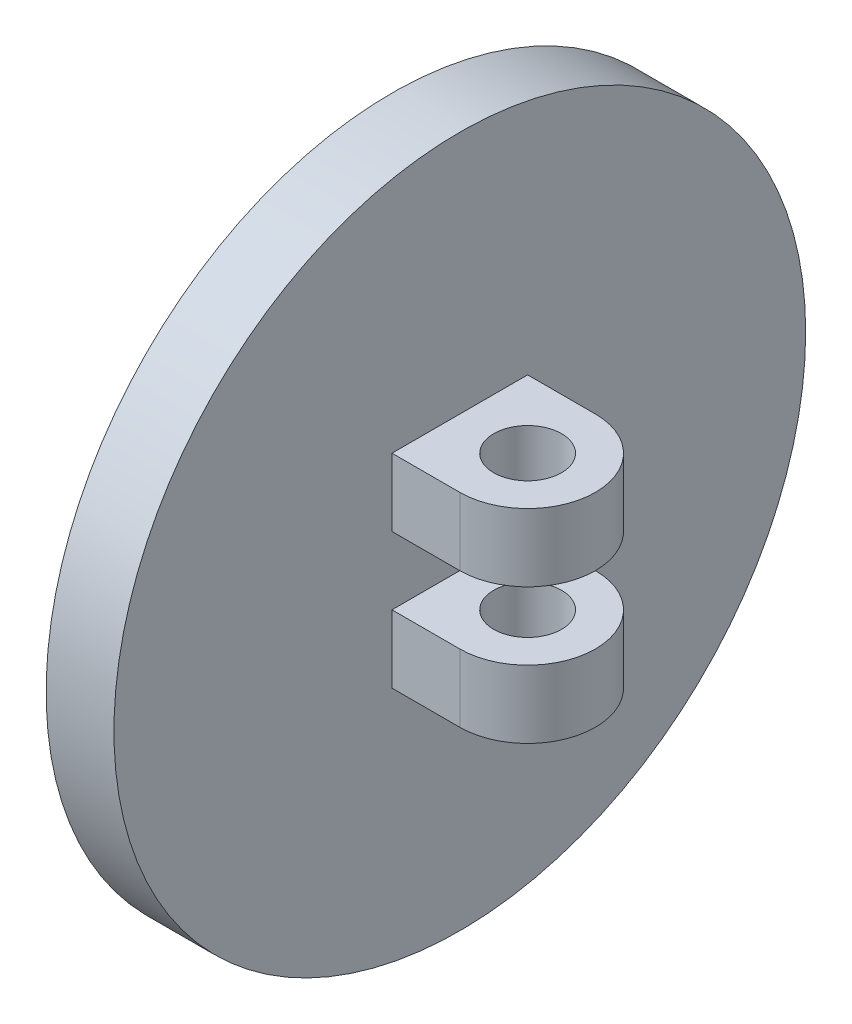
ISO-10303-21;
HEADER;
FILE_DESCRIPTION(('STEP AP214'),'2;1');
FILE_NAME('part.step','',(''),(''),'','','');
FILE_SCHEMA(('AUTOMOTIVE_DESIGN { 1 0 10303 214 1 1 1 1 }'));
ENDSEC;
DATA;
#1=APPLICATION_CONTEXT('core data for automotive mechanical design processes');
#2=APPLICATION_PROTOCOL_DEFINITION('international standard','automotive_design',2000,#1);
#3=PRODUCT_CONTEXT('',#1,'mechanical');
#4=PRODUCT('Part','Part','',(#3));
#5=PRODUCT_RELATED_PRODUCT_CATEGORY('part','',(#4));
#6=PRODUCT_DEFINITION_FORMATION('','',#4);
#7=PRODUCT_DEFINITION_CONTEXT('part definition',#1,'design');
#8=PRODUCT_DEFINITION('design','',#6,#7);
#9=PRODUCT_DEFINITION_SHAPE('','',#8);
#10=(LENGTH_UNIT() NAMED_UNIT(*) SI_UNIT(.MILLI.,.METRE.));
#11=(NAMED_UNIT(*) PLANE_ANGLE_UNIT() SI_UNIT($,.RADIAN.));
#12=(NAMED_UNIT(*) SI_UNIT($,.STERADIAN.) SOLID_ANGLE_UNIT());
#13=UNCERTAINTY_MEASURE_WITH_UNIT(LENGTH_MEASURE(1.E-05),#10,'distance_accuracy_value','');
#14=(GEOMETRIC_REPRESENTATION_CONTEXT(3) GLOBAL_UNCERTAINTY_ASSIGNED_CONTEXT((#13)) GLOBAL_UNIT_ASSIGNED_CONTEXT((#10,
#11,#12)) REPRESENTATION_CONTEXT('',''));
#15=CARTESIAN_POINT('',(0.,0.,0.));
#16=DIRECTION('',(0.,0.,1.));
#17=DIRECTION('',(1.,0.,0.));
#18=AXIS2_PLACEMENT_3D('',#15,#16,#17);
#19=CARTESIAN_POINT('',(1.,0.,0.));
#20=DIRECTION('',(1.,0.,0.));
#21=DIRECTION('',(0.,0.,-1.));
#22=AXIS2_PLACEMENT_3D('',#19,#20,#21);
#23=PLANE('',#22);
#24=CARTESIAN_POINT('',(1.,0.,0.));
#25=DIRECTION('',(1.,0.,0.));
#26=DIRECTION('',(0.,0.,-1.));
#27=AXIS2_PLACEMENT_3D('',#24,#25,#26);
#28=CIRCLE('',#27,5.1);
#29=CARTESIAN_POINT('',(1.,0.,-5.1));
#30=VERTEX_POINT('',#29);
#31=EDGE_CURVE('E11',#30,#30,#28,.T.);
#32=ORIENTED_EDGE('',*,*,#31,.T.);
#33=EDGE_LOOP('',(#32));
#34=FACE_BOUND('',#33,.T.);
#35=DIRECTION('',(0.,0.,1.));
#36=VECTOR('',#35,1.);
#37=CARTESIAN_POINT('',(1.,0.5,-1.));
#38=LINE('',#37,#36);
#39=CARTESIAN_POINT('',(1.,0.5,-1.));
#40=VERTEX_POINT('',#39);
#41=CARTESIAN_POINT('',(1.,0.5,1.));
#42=VERTEX_POINT('',#41);
#43=EDGE_CURVE('E147',#40,#42,#38,.T.);
#44=ORIENTED_EDGE('',*,*,#43,.T.);
#45=DIRECTION('',(0.,-1.,0.));
#46=VECTOR('',#45,1.);
#47=CARTESIAN_POINT('',(1.,1.5,1.));
#48=LINE('',#47,#46);
#49=CARTESIAN_POINT('',(1.,1.5,1.));
#50=VERTEX_POINT('',#49);
#51=EDGE_CURVE('E177',#50,#42,#48,.T.);
#52=ORIENTED_EDGE('',*,*,#51,.F.);
#53=DIRECTION('',(0.,0.,1.));
#54=VECTOR('',#53,1.);
#55=CARTESIAN_POINT('',(1.,1.5,-1.));
#56=LINE('',#55,#54);
#57=CARTESIAN_POINT('',(1.,1.5,-1.));
#58=VERTEX_POINT('',#57);
#59=EDGE_CURVE('E150',#58,#50,#56,.T.);
#60=ORIENTED_EDGE('',*,*,#59,.F.);
#61=DIRECTION('',(0.,-1.,0.));
#62=VECTOR('',#61,1.);
#63=CARTESIAN_POINT('',(1.,1.5,-1.));
#64=LINE('',#63,#62);
#65=EDGE_CURVE('E160',#58,#40,#64,.T.);
#66=ORIENTED_EDGE('',*,*,#65,.T.);
#67=EDGE_LOOP('',(#44,#52,#60,#66));
#68=FACE_BOUND('',#67,.T.);
#69=DIRECTION('',(0.,1.,0.));
#70=VECTOR('',#69,1.);
#71=CARTESIAN_POINT('',(1.,-1.5,-1.));
#72=LINE('',#71,#70);
#73=CARTESIAN_POINT('',(1.,-1.5,-1.));
#74=VERTEX_POINT('',#73);
#75=CARTESIAN_POINT('',(1.,-0.5,-1.));
#76=VERTEX_POINT('',#75);
#77=EDGE_CURVE('E56',#74,#76,#72,.T.);
#78=ORIENTED_EDGE('',*,*,#77,.F.);
#79=DIRECTION('',(0.,0.,1.));
#80=VECTOR('',#79,1.);
#81=CARTESIAN_POINT('',(1.,-1.5,-1.));
#82=LINE('',#81,#80);
#83=CARTESIAN_POINT('',(1.,-1.5,1.));
#84=VERTEX_POINT('',#83);
#85=EDGE_CURVE('E60',#74,#84,#82,.T.);
#86=ORIENTED_EDGE('',*,*,#85,.T.);
#87=DIRECTION('',(0.,1.,0.));
#88=VECTOR('',#87,1.);
#89=CARTESIAN_POINT('',(1.,-1.5,1.));
#90=LINE('',#89,#88);
#91=CARTESIAN_POINT('',(1.,-0.5,1.));
#92=VERTEX_POINT('',#91);
#93=EDGE_CURVE('E126',#84,#92,#90,.T.);
#94=ORIENTED_EDGE('',*,*,#93,.T.);
#95=DIRECTION('',(0.,0.,1.));
#96=VECTOR('',#95,1.);
#97=CARTESIAN_POINT('',(1.,-0.5,-1.));
#98=LINE('',#97,#96);
#99=EDGE_CURVE('E130',#76,#92,#98,.T.);
#100=ORIENTED_EDGE('',*,*,#99,.F.);
#101=EDGE_LOOP('',(#78,#86,#94,#100));
#102=FACE_BOUND('',#101,.T.);
#103=ADVANCED_FACE('F41',(#34,#68,#102),#23,.T.);
#104=CARTESIAN_POINT('',(1.,0.,0.));
#105=DIRECTION('',(-1.,0.,0.));
#106=DIRECTION('',(0.,0.,1.));
#107=AXIS2_PLACEMENT_3D('',#104,#105,#106);
#108=CYLINDRICAL_SURFACE('',#107,5.1);
#109=ORIENTED_EDGE('',*,*,#31,.F.);
#110=EDGE_LOOP('',(#109));
#111=FACE_BOUND('',#110,.T.);
#112=CARTESIAN_POINT('',(0.,0.,0.));
#113=DIRECTION('',(1.,0.,0.));
#114=DIRECTION('',(0.,0.,-1.));
#115=AXIS2_PLACEMENT_3D('',#112,#113,#114);
#116=CIRCLE('',#115,5.1);
#117=CARTESIAN_POINT('',(0.,0.,-5.1));
#118=VERTEX_POINT('',#117);
#119=EDGE_CURVE('E45',#118,#118,#116,.T.);
#120=ORIENTED_EDGE('',*,*,#119,.T.);
#121=EDGE_LOOP('',(#120));
#122=FACE_BOUND('',#121,.T.);
#123=ADVANCED_FACE('F43',(#111,#122),#108,.T.);
#124=CARTESIAN_POINT('',(0.,0.,0.));
#125=DIRECTION('',(1.,0.,0.));
#126=DIRECTION('',(0.,0.,-1.));
#127=AXIS2_PLACEMENT_3D('',#124,#125,#126);
#128=PLANE('',#127);
#129=ORIENTED_EDGE('',*,*,#119,.F.);
#130=EDGE_LOOP('',(#129));
#131=FACE_BOUND('',#130,.T.);
#132=ADVANCED_FACE('F185',(#131),#128,.F.);
#133=CARTESIAN_POINT('',(2.,1.5,0.));
#134=DIRECTION('',(0.,-1.,0.));
#135=DIRECTION('',(0.,0.,-1.));
#136=AXIS2_PLACEMENT_3D('',#133,#134,#135);
#137=PLANE('',#136);
#138=ORIENTED_EDGE('',*,*,#59,.T.);
#139=DIRECTION('',(1.,0.,0.));
#140=VECTOR('',#139,1.);
#141=CARTESIAN_POINT('',(2.,1.5,1.));
#142=LINE('',#141,#140);
#143=CARTESIAN_POINT('',(2.,1.5,1.));
#144=VERTEX_POINT('',#143);
#145=EDGE_CURVE('E153',#50,#144,#142,.T.);
#146=ORIENTED_EDGE('',*,*,#145,.T.);
#147=CARTESIAN_POINT('',(2.,1.5,0.));
#148=DIRECTION('',(0.,1.,0.));
#149=DIRECTION('',(0.,0.,-1.));
#150=AXIS2_PLACEMENT_3D('',#147,#148,#149);
#151=CIRCLE('',#150,1.);
#152=CARTESIAN_POINT('',(2.,1.5,-1.));
#153=VERTEX_POINT('',#152);
#154=EDGE_CURVE('E156',#144,#153,#151,.T.);
#155=ORIENTED_EDGE('',*,*,#154,.T.);
#156=DIRECTION('',(-1.,0.,0.));
#157=VECTOR('',#156,1.);
#158=CARTESIAN_POINT('',(1.,1.5,-1.));
#159=LINE('',#158,#157);
#160=EDGE_CURVE('E158',#153,#58,#159,.T.);
#161=ORIENTED_EDGE('',*,*,#160,.T.);
#162=EDGE_LOOP('',(#138,#146,#155,#161));
#163=FACE_BOUND('',#162,.T.);
#164=CARTESIAN_POINT('',(2.,1.5,0.));
#165=DIRECTION('',(0.,1.,0.));
#166=DIRECTION('',(0.,0.,1.));
#167=AXIS2_PLACEMENT_3D('',#164,#165,#166);
#168=CIRCLE('',#167,0.499999999999999);
#169=CARTESIAN_POINT('',(2.,1.5,0.499999999999999));
#170=VERTEX_POINT('',#169);
#171=EDGE_CURVE('E144',#170,#170,#168,.T.);
#172=ORIENTED_EDGE('',*,*,#171,.F.);
#173=EDGE_LOOP('',(#172));
#174=FACE_BOUND('',#173,.T.);
#175=ADVANCED_FACE('F187',(#163,#174),#137,.F.);
#176=CARTESIAN_POINT('',(2.,0.5,0.));
#177=DIRECTION('',(0.,-1.,0.));
#178=DIRECTION('',(0.,0.,-1.));
#179=AXIS2_PLACEMENT_3D('',#176,#177,#178);
#180=PLANE('',#179);
#181=ORIENTED_EDGE('',*,*,#43,.F.);
#182=DIRECTION('',(-1.,0.,0.));
#183=VECTOR('',#182,1.);
#184=CARTESIAN_POINT('',(1.,0.5,-1.));
#185=LINE('',#184,#183);
#186=CARTESIAN_POINT('',(2.,0.5,-1.));
#187=VERTEX_POINT('',#186);
#188=EDGE_CURVE('E154',#187,#40,#185,.T.);
#189=ORIENTED_EDGE('',*,*,#188,.F.);
#190=CARTESIAN_POINT('',(2.,0.5,0.));
#191=DIRECTION('',(0.,1.,0.));
#192=DIRECTION('',(0.,0.,-1.));
#193=AXIS2_PLACEMENT_3D('',#190,#191,#192);
#194=CIRCLE('',#193,1.);
#195=CARTESIAN_POINT('',(2.,0.5,1.));
#196=VERTEX_POINT('',#195);
#197=EDGE_CURVE('E165',#196,#187,#194,.T.);
#198=ORIENTED_EDGE('',*,*,#197,.F.);
#199=DIRECTION('',(1.,0.,0.));
#200=VECTOR('',#199,1.);
#201=CARTESIAN_POINT('',(2.,0.5,1.));
#202=LINE('',#201,#200);
#203=EDGE_CURVE('E163',#42,#196,#202,.T.);
#204=ORIENTED_EDGE('',*,*,#203,.F.);
#205=EDGE_LOOP('',(#181,#189,#198,#204));
#206=FACE_BOUND('',#205,.T.);
#207=CARTESIAN_POINT('',(2.,0.5,0.));
#208=DIRECTION('',(0.,1.,0.));
#209=DIRECTION('',(0.,0.,1.));
#210=AXIS2_PLACEMENT_3D('',#207,#208,#209);
#211=CIRCLE('',#210,0.499999999999999);
#212=CARTESIAN_POINT('',(2.,0.5,0.499999999999999));
#213=VERTEX_POINT('',#212);
#214=EDGE_CURVE('E143',#213,#213,#211,.T.);
#215=ORIENTED_EDGE('',*,*,#214,.T.);
#216=EDGE_LOOP('',(#215));
#217=FACE_BOUND('',#216,.T.);
#218=ADVANCED_FACE('F192',(#206,#217),#180,.T.);
#219=CARTESIAN_POINT('',(2.,1.5,1.));
#220=DIRECTION('',(0.,0.,-1.));
#221=DIRECTION('',(-1.,0.,0.));
#222=AXIS2_PLACEMENT_3D('',#219,#220,#221);
#223=PLANE('',#222);
#224=ORIENTED_EDGE('',*,*,#203,.T.);
#225=DIRECTION('',(0.,-1.,0.));
#226=VECTOR('',#225,1.);
#227=CARTESIAN_POINT('',(2.,1.5,1.));
#228=LINE('',#227,#226);
#229=EDGE_CURVE('E174',#144,#196,#228,.T.);
#230=ORIENTED_EDGE('',*,*,#229,.F.);
#231=ORIENTED_EDGE('',*,*,#145,.F.);
#232=ORIENTED_EDGE('',*,*,#51,.T.);
#233=EDGE_LOOP('',(#224,#230,#231,#232));
#234=FACE_BOUND('',#233,.T.);
#235=ADVANCED_FACE('F205',(#234),#223,.F.);
#236=CARTESIAN_POINT('',(2.,1.5,0.));
#237=DIRECTION('',(0.,-1.,0.));
#238=DIRECTION('',(0.,0.,-1.));
#239=AXIS2_PLACEMENT_3D('',#236,#237,#238);
#240=CYLINDRICAL_SURFACE('',#239,1.);
#241=ORIENTED_EDGE('',*,*,#197,.T.);
#242=DIRECTION('',(0.,-1.,0.));
#243=VECTOR('',#242,1.);
#244=CARTESIAN_POINT('',(2.,1.5,-1.));
#245=LINE('',#244,#243);
#246=EDGE_CURVE('E171',#153,#187,#245,.T.);
#247=ORIENTED_EDGE('',*,*,#246,.F.);
#248=ORIENTED_EDGE('',*,*,#154,.F.);
#249=ORIENTED_EDGE('',*,*,#229,.T.);
#250=EDGE_LOOP('',(#241,#247,#248,#249));
#251=FACE_BOUND('',#250,.T.);
#252=ADVANCED_FACE('F208',(#251),#240,.T.);
#253=CARTESIAN_POINT('',(1.,1.5,-1.));
#254=DIRECTION('',(0.,0.,1.));
#255=DIRECTION('',(1.,0.,0.));
#256=AXIS2_PLACEMENT_3D('',#253,#254,#255);
#257=PLANE('',#256);
#258=ORIENTED_EDGE('',*,*,#188,.T.);
#259=ORIENTED_EDGE('',*,*,#65,.F.);
#260=ORIENTED_EDGE('',*,*,#160,.F.);
#261=ORIENTED_EDGE('',*,*,#246,.T.);
#262=EDGE_LOOP('',(#258,#259,#260,#261));
#263=FACE_BOUND('',#262,.T.);
#264=ADVANCED_FACE('F211',(#263),#257,.F.);
#265=CARTESIAN_POINT('',(2.,1.5,0.));
#266=DIRECTION('',(0.,-1.,0.));
#267=DIRECTION('',(0.,0.,-1.));
#268=AXIS2_PLACEMENT_3D('',#265,#266,#267);
#269=CYLINDRICAL_SURFACE('',#268,0.499999999999999);
#270=ORIENTED_EDGE('',*,*,#171,.T.);
#271=EDGE_LOOP('',(#270));
#272=FACE_BOUND('',#271,.T.);
#273=ORIENTED_EDGE('',*,*,#214,.F.);
#274=EDGE_LOOP('',(#273));
#275=FACE_BOUND('',#274,.T.);
#276=ADVANCED_FACE('F215',(#272,#275),#269,.F.);
#277=CARTESIAN_POINT('',(1.,-1.5,-1.));
#278=DIRECTION('',(0.,0.,-1.));
#279=DIRECTION('',(-1.,0.,0.));
#280=AXIS2_PLACEMENT_3D('',#277,#278,#279);
#281=PLANE('',#280);
#282=DIRECTION('',(-1.,0.,0.));
#283=VECTOR('',#282,1.);
#284=CARTESIAN_POINT('',(1.,-0.5,-1.));
#285=LINE('',#284,#283);
#286=CARTESIAN_POINT('',(2.,-0.5,-1.));
#287=VERTEX_POINT('',#286);
#288=EDGE_CURVE('E109',#287,#76,#285,.T.);
#289=ORIENTED_EDGE('',*,*,#288,.F.);
#290=DIRECTION('',(0.,1.,0.));
#291=VECTOR('',#290,1.);
#292=CARTESIAN_POINT('',(2.,-1.5,-1.));
#293=LINE('',#292,#291);
#294=CARTESIAN_POINT('',(2.,-1.5,-1.));
#295=VERTEX_POINT('',#294);
#296=EDGE_CURVE('E104',#295,#287,#293,.T.);
#297=ORIENTED_EDGE('',*,*,#296,.F.);
#298=DIRECTION('',(-1.,0.,0.));
#299=VECTOR('',#298,1.);
#300=CARTESIAN_POINT('',(1.,-1.5,-1.));
#301=LINE('',#300,#299);
#302=EDGE_CURVE('E107',#295,#74,#301,.T.);
#303=ORIENTED_EDGE('',*,*,#302,.T.);
#304=ORIENTED_EDGE('',*,*,#77,.T.);
#305=EDGE_LOOP('',(#289,#297,#303,#304));
#306=FACE_BOUND('',#305,.T.);
#307=ADVANCED_FACE('F106',(#306),#281,.T.);
#308=CARTESIAN_POINT('',(2.,-1.5,0.));
#309=DIRECTION('',(0.,1.,0.));
#310=DIRECTION('',(0.,0.,1.));
#311=AXIS2_PLACEMENT_3D('',#308,#309,#310);
#312=CYLINDRICAL_SURFACE('',#311,1.);
#313=CARTESIAN_POINT('',(2.,-0.5,0.));
#314=DIRECTION('',(0.,1.,0.));
#315=DIRECTION('',(0.,0.,-1.));
#316=AXIS2_PLACEMENT_3D('',#313,#314,#315);
#317=CIRCLE('',#316,1.);
#318=CARTESIAN_POINT('',(2.,-0.5,1.));
#319=VERTEX_POINT('',#318);
#320=EDGE_CURVE('E135',#319,#287,#317,.T.);
#321=ORIENTED_EDGE('',*,*,#320,.F.);
#322=DIRECTION('',(0.,1.,0.));
#323=VECTOR('',#322,1.);
#324=CARTESIAN_POINT('',(2.,-1.5,1.));
#325=LINE('',#324,#323);
#326=CARTESIAN_POINT('',(2.,-1.5,1.));
#327=VERTEX_POINT('',#326);
#328=EDGE_CURVE('E114',#327,#319,#325,.T.);
#329=ORIENTED_EDGE('',*,*,#328,.F.);
#330=CARTESIAN_POINT('',(2.,-1.5,0.));
#331=DIRECTION('',(0.,1.,0.));
#332=DIRECTION('',(0.,0.,-1.));
#333=AXIS2_PLACEMENT_3D('',#330,#331,#332);
#334=CIRCLE('',#333,1.);
#335=EDGE_CURVE('E120',#327,#295,#334,.T.);
#336=ORIENTED_EDGE('',*,*,#335,.T.);
#337=ORIENTED_EDGE('',*,*,#296,.T.);
#338=EDGE_LOOP('',(#321,#329,#336,#337));
#339=FACE_BOUND('',#338,.T.);
#340=ADVANCED_FACE('F123',(#339),#312,.T.);
#341=CARTESIAN_POINT('',(2.,-1.5,1.));
#342=DIRECTION('',(0.,0.,1.));
#343=DIRECTION('',(1.,0.,0.));
#344=AXIS2_PLACEMENT_3D('',#341,#342,#343);
#345=PLANE('',#344);
#346=DIRECTION('',(1.,0.,0.));
#347=VECTOR('',#346,1.);
#348=CARTESIAN_POINT('',(2.,-0.5,1.));
#349=LINE('',#348,#347);
#350=EDGE_CURVE('E137',#92,#319,#349,.T.);
#351=ORIENTED_EDGE('',*,*,#350,.F.);
#352=ORIENTED_EDGE('',*,*,#93,.F.);
#353=DIRECTION('',(1.,0.,0.));
#354=VECTOR('',#353,1.);
#355=CARTESIAN_POINT('',(2.,-1.5,1.));
#356=LINE('',#355,#354);
#357=EDGE_CURVE('E124',#84,#327,#356,.T.);
#358=ORIENTED_EDGE('',*,*,#357,.T.);
#359=ORIENTED_EDGE('',*,*,#328,.T.);
#360=EDGE_LOOP('',(#351,#352,#358,#359));
#361=FACE_BOUND('',#360,.T.);
#362=ADVANCED_FACE('F225',(#361),#345,.T.);
#363=CARTESIAN_POINT('',(2.,-1.5,0.));
#364=DIRECTION('',(0.,1.,0.));
#365=DIRECTION('',(0.,0.,-1.));
#366=AXIS2_PLACEMENT_3D('',#363,#364,#365);
#367=PLANE('',#366);
#368=CARTESIAN_POINT('',(2.,-1.5,0.));
#369=DIRECTION('',(0.,1.,0.));
#370=DIRECTION('',(0.,0.,1.));
#371=AXIS2_PLACEMENT_3D('',#368,#369,#370);
#372=CIRCLE('',#371,0.499999999999999);
#373=CARTESIAN_POINT('',(2.,-1.5,0.499999999999999));
#374=VERTEX_POINT('',#373);
#375=EDGE_CURVE('E133',#374,#374,#372,.T.);
#376=ORIENTED_EDGE('',*,*,#375,.T.);
#377=EDGE_LOOP('',(#376));
#378=FACE_BOUND('',#377,.T.);
#379=ORIENTED_EDGE('',*,*,#85,.F.);
#380=ORIENTED_EDGE('',*,*,#302,.F.);
#381=ORIENTED_EDGE('',*,*,#335,.F.);
#382=ORIENTED_EDGE('',*,*,#357,.F.);
#383=EDGE_LOOP('',(#379,#380,#381,#382));
#384=FACE_BOUND('',#383,.T.);
#385=ADVANCED_FACE('F118',(#378,#384),#367,.F.);
#386=CARTESIAN_POINT('',(2.,-0.5,0.));
#387=DIRECTION('',(0.,1.,0.));
#388=DIRECTION('',(0.,0.,-1.));
#389=AXIS2_PLACEMENT_3D('',#386,#387,#388);
#390=PLANE('',#389);
#391=CARTESIAN_POINT('',(2.,-0.5,0.));
#392=DIRECTION('',(0.,1.,0.));
#393=DIRECTION('',(0.,0.,1.));
#394=AXIS2_PLACEMENT_3D('',#391,#392,#393);
#395=CIRCLE('',#394,0.499999999999999);
#396=CARTESIAN_POINT('',(2.,-0.5,0.499999999999999));
#397=VERTEX_POINT('',#396);
#398=EDGE_CURVE('E246',#397,#397,#395,.T.);
#399=ORIENTED_EDGE('',*,*,#398,.F.);
#400=EDGE_LOOP('',(#399));
#401=FACE_BOUND('',#400,.T.);
#402=ORIENTED_EDGE('',*,*,#99,.T.);
#403=ORIENTED_EDGE('',*,*,#350,.T.);
#404=ORIENTED_EDGE('',*,*,#320,.T.);
#405=ORIENTED_EDGE('',*,*,#288,.T.);
#406=EDGE_LOOP('',(#402,#403,#404,#405));
#407=FACE_BOUND('',#406,.T.);
#408=ADVANCED_FACE('F229',(#401,#407),#390,.T.);
#409=CARTESIAN_POINT('',(2.,-1.5,0.));
#410=DIRECTION('',(0.,1.,0.));
#411=DIRECTION('',(0.,0.,1.));
#412=AXIS2_PLACEMENT_3D('',#409,#410,#411);
#413=CYLINDRICAL_SURFACE('',#412,0.499999999999999);
#414=ORIENTED_EDGE('',*,*,#375,.F.);
#415=EDGE_LOOP('',(#414));
#416=FACE_BOUND('',#415,.T.);
#417=ORIENTED_EDGE('',*,*,#398,.T.);
#418=EDGE_LOOP('',(#417));
#419=FACE_BOUND('',#418,.T.);
#420=ADVANCED_FACE('F232',(#416,#419),#413,.F.);
#421=CLOSED_SHELL('',(#103,#123,#132,#175,#218,#235,#252,#264,#276,#307,#340,#362,#385,#408,#420));
#422=MANIFOLD_SOLID_BREP('B2',#421);
#423=ADVANCED_BREP_SHAPE_REPRESENTATION('',(#18,#422),#14);
#424=SHAPE_DEFINITION_REPRESENTATION(#9,#423);
ENDSEC;
END-ISO-10303-21;
